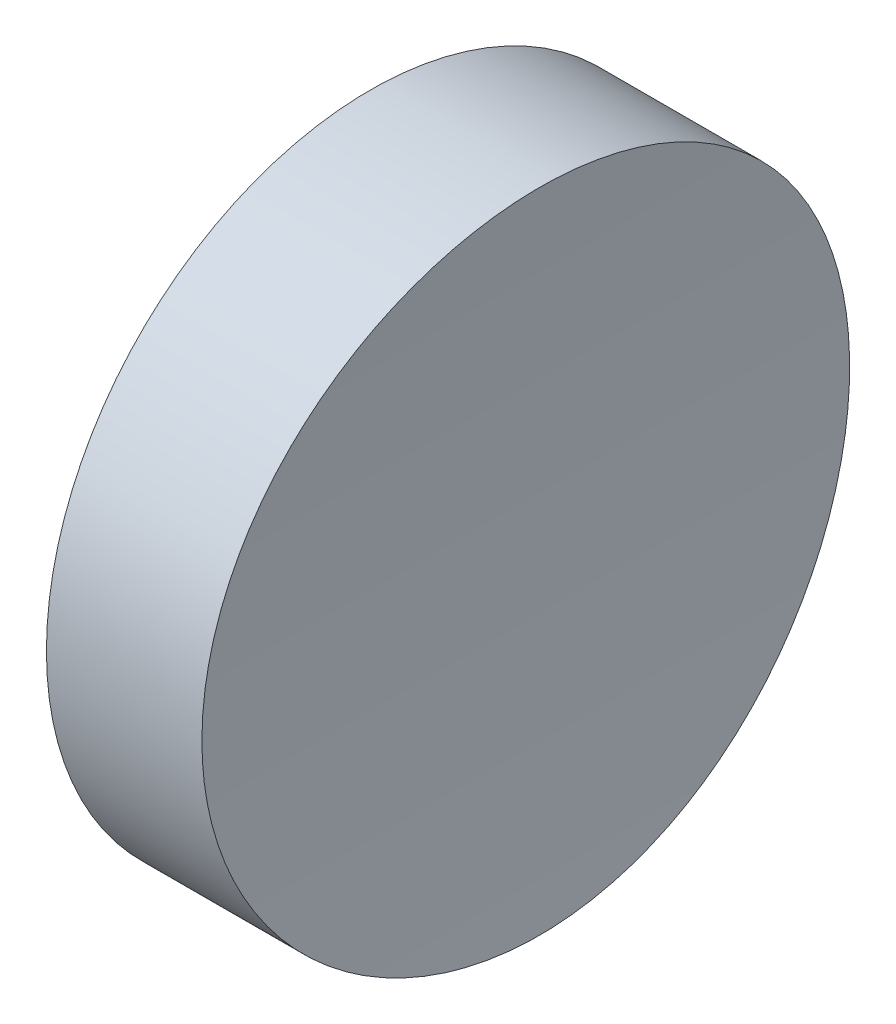
ISO-10303-21;
HEADER;
FILE_DESCRIPTION(('STEP AP214'),'2;1');
FILE_NAME('part.step','',(''),(''),'','','');
FILE_SCHEMA(('AUTOMOTIVE_DESIGN { 1 0 10303 214 1 1 1 1 }'));
ENDSEC;
DATA;
#1=APPLICATION_CONTEXT('core data for automotive mechanical design processes');
#2=APPLICATION_PROTOCOL_DEFINITION('international standard','automotive_design',2000,#1);
#3=PRODUCT_CONTEXT('',#1,'mechanical');
#4=PRODUCT('Part','Part','',(#3));
#5=PRODUCT_RELATED_PRODUCT_CATEGORY('part','',(#4));
#6=PRODUCT_DEFINITION_FORMATION('','',#4);
#7=PRODUCT_DEFINITION_CONTEXT('part definition',#1,'design');
#8=PRODUCT_DEFINITION('design','',#6,#7);
#9=PRODUCT_DEFINITION_SHAPE('','',#8);
#10=(LENGTH_UNIT() NAMED_UNIT(*) SI_UNIT(.MILLI.,.METRE.));
#11=(NAMED_UNIT(*) PLANE_ANGLE_UNIT() SI_UNIT($,.RADIAN.));
#12=(NAMED_UNIT(*) SI_UNIT($,.STERADIAN.) SOLID_ANGLE_UNIT());
#13=UNCERTAINTY_MEASURE_WITH_UNIT(LENGTH_MEASURE(1.E-05),#10,'distance_accuracy_value','');
#14=(GEOMETRIC_REPRESENTATION_CONTEXT(3) GLOBAL_UNCERTAINTY_ASSIGNED_CONTEXT((#13)) GLOBAL_UNIT_ASSIGNED_CONTEXT((#10,
#11,#12)) REPRESENTATION_CONTEXT('',''));
#15=CARTESIAN_POINT('',(0.,0.,0.));
#16=DIRECTION('',(0.,0.,1.));
#17=DIRECTION('',(1.,0.,0.));
#18=AXIS2_PLACEMENT_3D('',#15,#16,#17);
#19=CARTESIAN_POINT('',(10.,0.,0.));
#20=DIRECTION('',(-1.,0.,0.));
#21=DIRECTION('',(0.,0.,1.));
#22=AXIS2_PLACEMENT_3D('',#19,#20,#21);
#23=CYLINDRICAL_SURFACE('',#22,12.5);
#24=CARTESIAN_POINT('',(5.99999999999998,0.,12.5));
#25=CARTESIAN_POINT('',(5.99999928146033,0.350537754396186,12.5000031495883));
#26=CARTESIAN_POINT('',(6.0012312827096,0.701026373216591,12.4852490726767));
#27=CARTESIAN_POINT('',(6.00612333447652,1.39962024008817,12.4263402743586));
#28=CARTESIAN_POINT('',(6.00978398461746,1.7477248780951,12.3821782922528));
#29=CARTESIAN_POINT('',(6.01943610217294,2.43930253725407,12.26470389551));
#30=CARTESIAN_POINT('',(6.02542992274448,2.78277051902057,12.1913620493917));
#31=CARTESIAN_POINT('',(6.03957819863503,3.46227926252326,12.0160614654325));
#32=CARTESIAN_POINT('',(6.04773264928052,3.79832004032309,11.914102789491));
#33=CARTESIAN_POINT('',(6.06596626541404,4.46039786220219,11.6823710709163));
#34=CARTESIAN_POINT('',(6.07604432051498,4.78644055219778,11.5526140694069));
#35=CARTESIAN_POINT('',(6.0978438268502,5.42642639750804,11.2661796907292));
#36=CARTESIAN_POINT('',(6.10956530212955,5.74036937570474,11.1095019196725));
#37=CARTESIAN_POINT('',(6.13431824496103,6.35387095131918,10.7703826988102));
#38=CARTESIAN_POINT('',(6.14734941937173,6.65343274550162,10.5879470105476));
#39=CARTESIAN_POINT('',(6.17435691761398,7.23614274206486,10.1985797020899));
#40=CARTESIAN_POINT('',(6.18833323979202,7.51929097315935,9.99164812474965));
#41=CARTESIAN_POINT('',(6.21686991078753,8.06780950182983,9.55425424401204));
#42=CARTESIAN_POINT('',(6.23143150925087,8.33313813367743,9.32373976902612));
#43=CARTESIAN_POINT('',(6.2606971957962,8.84344570500622,8.8411980957912));
#44=CARTESIAN_POINT('',(6.27540128420837,9.08842459732109,8.58917084768296));
#45=CARTESIAN_POINT('',(6.30453645727553,9.55631508060749,8.06536854380081));
#46=CARTESIAN_POINT('',(6.3189675300547,9.779225713416,7.79359263146396));
#47=CARTESIAN_POINT('',(6.3471470781203,10.2013912999658,7.23221662343334));
#48=CARTESIAN_POINT('',(6.36089555325487,10.4006462484445,6.9426165237743));
#49=CARTESIAN_POINT('',(6.38733895253603,10.7743590342736,6.34719730255701));
#50=CARTESIAN_POINT('',(6.40003230707307,10.9487801939426,6.04135508875667));
#51=CARTESIAN_POINT('',(6.42398082168204,11.2712305985622,5.41600588054904));
#52=CARTESIAN_POINT('',(6.43523597987367,11.4192598090079,5.09649886827695));
#53=CARTESIAN_POINT('',(6.4559860375815,11.6878588861224,4.4460933167239));
#54=CARTESIAN_POINT('',(6.46548096178339,11.8084291378836,4.11519493727364));
#55=CARTESIAN_POINT('',(6.48243851380208,12.021240058768,3.44435967779192));
#56=CARTESIAN_POINT('',(6.48990114666187,12.113480798189,3.10442282019107));
#57=CARTESIAN_POINT('',(6.50256490465505,12.2687800060287,2.41874282570008));
#58=CARTESIAN_POINT('',(6.50777128099369,12.3319062576904,2.07301513732543));
#59=CARTESIAN_POINT('',(6.51579874392335,12.428835236807,1.37744579459053));
#60=CARTESIAN_POINT('',(6.5186198338476,12.462638005239,1.02760414597988));
#61=CARTESIAN_POINT('',(6.52179579190806,12.5006733071993,0.326311773981347));
#62=CARTESIAN_POINT('',(6.52215070140543,12.5049063366519,-0.0251389223217206));
#63=CARTESIAN_POINT('',(6.52038421766945,12.4837725478088,-0.727142680080485));
#64=CARTESIAN_POINT('',(6.51826282774346,12.4584057690467,-1.07769574273444));
#65=CARTESIAN_POINT('',(6.51161300085618,12.3783583715258,-1.77452230633597));
#66=CARTESIAN_POINT('',(6.50709062363346,12.3237515473762,-2.12080434534615));
#67=CARTESIAN_POINT('',(6.49577155498858,12.1856665327574,-2.8075245167755));
#68=CARTESIAN_POINT('',(6.48897486797711,12.1021883982798,-3.1479626605267));
#69=CARTESIAN_POINT('',(6.47330061137972,11.906962237216,-3.82058709979784));
#70=CARTESIAN_POINT('',(6.46442302710651,11.7952140110946,-4.15277333705625));
#71=CARTESIAN_POINT('',(6.44483920460298,11.5442500192157,-4.80654688145646));
#72=CARTESIAN_POINT('',(6.43413296294578,11.4050342019842,-5.1281341687346));
#73=CARTESIAN_POINT('',(6.4111809805038,11.0999388130492,-5.75883922992113));
#74=CARTESIAN_POINT('',(6.39893333828257,10.9340262371883,-6.06794096893111));
#75=CARTESIAN_POINT('',(6.37325621908973,10.5768421254075,-6.67107556638572));
#76=CARTESIAN_POINT('',(6.35982674148264,10.3855705758516,-6.96510841672741));
#77=CARTESIAN_POINT('',(6.33216553062023,9.97901904443404,-7.53604635099387));
#78=CARTESIAN_POINT('',(6.31793378366521,9.76373865253137,-7.8129511422672));
#79=CARTESIAN_POINT('',(6.28906997516907,9.31068930058814,-8.34768616760569));
#80=CARTESIAN_POINT('',(6.27443791277051,9.07292029237624,-8.60551636081034));
#81=CARTESIAN_POINT('',(6.24514117853455,8.57580467050511,-9.1010504528943));
#82=CARTESIAN_POINT('',(6.23047654381058,8.31639429480903,-9.33869039322468));
#83=CARTESIAN_POINT('',(6.20157503676616,7.77845829161841,-9.79127877092119));
#84=CARTESIAN_POINT('',(6.18733816537446,7.49993262262623,-10.0062271590234));
#85=CARTESIAN_POINT('',(6.15969549519396,6.92573076623681,-10.4119078143583));
#86=CARTESIAN_POINT('',(6.14628969804599,6.63005454498069,-10.6026400337808));
#87=CARTESIAN_POINT('',(6.1206891095364,6.02364083883929,-10.9585286064737));
#88=CARTESIAN_POINT('',(6.10849431705849,5.71290336783776,-11.1236849833197));
#89=CARTESIAN_POINT('',(6.08566030169242,5.07853190429446,-11.4272556792948));
#90=CARTESIAN_POINT('',(6.07502124876219,4.75489650761649,-11.5656670771788));
#91=CARTESIAN_POINT('',(6.05560238636079,4.0970591260334,-11.8147281602823));
#92=CARTESIAN_POINT('',(6.04682257767529,3.76285713666319,-11.9253778337704));
#93=CARTESIAN_POINT('',(6.03137192915,3.08627344867466,-12.1181121422099));
#94=CARTESIAN_POINT('',(6.02470105351482,2.74389188899613,-12.2001972619962));
#95=CARTESIAN_POINT('',(6.01365793067234,2.05339058140679,-12.3352073790356));
#96=CARTESIAN_POINT('',(6.00928567753806,1.70527084829418,-12.3881324514775));
#97=CARTESIAN_POINT('',(6.00297375724905,1.00683381188401,-12.4643219427479));
#98=CARTESIAN_POINT('',(6.00102684947684,0.656526202705502,-12.487674650278));
#99=CARTESIAN_POINT('',(5.99959679867223,-0.0448167124021891,-12.5048404592398));
#100=CARTESIAN_POINT('',(6.00011365075054,-0.395852016885884,-12.4986536192926));
#101=CARTESIAN_POINT('',(6.00359645727859,-1.09614364513738,-12.4567856464168));
#102=CARTESIAN_POINT('',(6.00656238976312,-1.44539998483202,-12.421104778013));
#103=CARTESIAN_POINT('',(6.01485932370455,-2.13964801915374,-12.3205085648779));
#104=CARTESIAN_POINT('',(6.02019032468183,-2.48463971464565,-12.2555932260751));
#105=CARTESIAN_POINT('',(6.03305729640805,-3.16741633217468,-12.097112223057));
#106=CARTESIAN_POINT('',(6.04059010950767,-3.50521083660663,-12.0035875789644));
#107=CARTESIAN_POINT('',(6.05765117775656,-4.17171048696242,-11.7885304224186));
#108=CARTESIAN_POINT('',(6.06717943032533,-4.50041564463991,-11.666997946185));
#109=CARTESIAN_POINT('',(6.08796317719186,-5.14642297681508,-11.3967941230233));
#110=CARTESIAN_POINT('',(6.0992186926505,-5.46372501155306,-11.2481224436056));
#111=CARTESIAN_POINT('',(6.12314026812197,-6.08469189106629,-10.9247002689698));
#112=CARTESIAN_POINT('',(6.13580633156477,-6.388356702678,-10.7499497103364));
#113=CARTESIAN_POINT('',(6.16222406542286,-6.98061545800222,-10.3751676631252));
#114=CARTESIAN_POINT('',(6.17597821761808,-7.26917229931269,-10.1750777162666));
#115=CARTESIAN_POINT('',(6.20415792203051,-7.82841625997504,-9.75135748159222));
#116=CARTESIAN_POINT('',(6.21858347518462,-8.09910335438983,-9.52772716092724));
#117=CARTESIAN_POINT('',(6.24769913592004,-8.62070966740436,-9.05850033462086));
#118=CARTESIAN_POINT('',(6.2623892475736,-8.87162858139986,-8.81290349062584));
#119=CARTESIAN_POINT('',(6.29161906646477,-9.35192933719651,-8.30147458126343));
#120=CARTESIAN_POINT('',(6.30615877350483,-9.58131115071401,-8.03564248932291));
#121=CARTESIAN_POINT('',(6.33471233184105,-10.0174629899683,-7.48492621612523));
#122=CARTESIAN_POINT('',(6.34872478465277,-10.2241753316163,-7.19999627428991));
#123=CARTESIAN_POINT('',(6.37578685902222,-10.6128606640624,-6.61369008796645));
#124=CARTESIAN_POINT('',(6.388836478729,-10.7948336073015,-6.31231381186345));
#125=CARTESIAN_POINT('',(6.41360072671689,-11.1327384965014,-5.69524970587708));
#126=CARTESIAN_POINT('',(6.42531536464488,-11.2886706306427,-5.37956197943448));
#127=CARTESIAN_POINT('',(6.44707495895922,-11.5733749752995,-4.73611252658949));
#128=CARTESIAN_POINT('',(6.45711991851666,-11.7021472373976,-4.40835082311971));
#129=CARTESIAN_POINT('',(6.47524105989593,-11.9314578630839,-3.7435023495797));
#130=CARTESIAN_POINT('',(6.4833196941744,-12.0320314209429,-3.40642778544829));
#131=CARTESIAN_POINT('',(6.49729310428606,-12.2044303179048,-2.7249605060704));
#132=CARTESIAN_POINT('',(6.50318788132406,-12.2762556728677,-2.38056779486136));
#133=CARTESIAN_POINT('',(6.51262435945935,-12.3906345006923,-1.68692887576776));
#134=CARTESIAN_POINT('',(6.5161660982026,-12.4331884418642,-1.3376827456237));
#135=CARTESIAN_POINT('',(6.52079487519413,-12.4887154978616,-0.636830870202419));
#136=CARTESIAN_POINT('',(6.52188191876449,-12.5016886768221,-0.285225130042782));
#137=CARTESIAN_POINT('',(6.52157057268264,-12.497965356281,0.416752217799929));
#138=CARTESIAN_POINT('',(6.52017977002853,-12.4813594260491,0.767124312682886));
#139=CARTESIAN_POINT('',(6.51496720479426,-12.4187742209256,1.46521624440075));
#140=CARTESIAN_POINT('',(6.51114544751155,-12.3727950100434,1.81293608701368));
#141=CARTESIAN_POINT('',(6.50118009481151,-12.2517968263356,2.50325168598202));
#142=CARTESIAN_POINT('',(6.49503649895016,-12.1767778479563,2.84584744135748));
#143=CARTESIAN_POINT('',(6.48060263209619,-11.9982424605483,3.52348479078322));
#144=CARTESIAN_POINT('',(6.47231235909712,-11.8947260248835,3.85852637777244));
#145=CARTESIAN_POINT('',(6.45382163339658,-11.659948061712,4.51866459979813));
#146=CARTESIAN_POINT('',(6.44362129942763,-11.5286882587132,4.8437618515302));
#147=CARTESIAN_POINT('',(6.42159969040552,-11.2393592320345,5.48174120929249));
#148=CARTESIAN_POINT('',(6.40977841570631,-11.0812900142089,5.79462331799004));
#149=CARTESIAN_POINT('',(6.38484994113602,-10.7394702994248,6.40596762405079));
#150=CARTESIAN_POINT('',(6.37174276584707,-10.5557202933691,6.70443009690677));
#151=CARTESIAN_POINT('',(6.34461261678337,-10.1638372440364,7.28484920740848));
#152=CARTESIAN_POINT('',(6.33058964155154,-9.95570416196478,7.56680581879155));
#153=CARTESIAN_POINT('',(6.30198155676177,-9.51587956857796,8.11303563657764));
#154=CARTESIAN_POINT('',(6.28739492585279,-9.28412106526727,8.37725482411943));
#155=CARTESIAN_POINT('',(6.25811117322026,-8.79918843661238,8.88524550055078));
#156=CARTESIAN_POINT('',(6.24341405087085,-8.54601418987609,9.12901687351922));
#157=CARTESIAN_POINT('',(6.21432150833528,-8.01996944256351,9.59444931992474));
#158=CARTESIAN_POINT('',(6.19992616376838,-7.74709407965361,9.8161049027005));
#159=CARTESIAN_POINT('',(6.17184836662671,-7.18362934345751,10.235665544384));
#160=CARTESIAN_POINT('',(6.15816590358759,-6.89304023032665,10.4335709519751));
#161=CARTESIAN_POINT('',(6.13187611054748,-6.29563234698706,10.8045767090777));
#162=CARTESIAN_POINT('',(6.11927084264579,-5.98878419301035,10.9776298959265));
#163=CARTESIAN_POINT('',(6.09552233611512,-5.36153611761585,11.2972489779576));
#164=CARTESIAN_POINT('',(6.08437910088157,-5.04113616472762,11.4438148116258));
#165=CARTESIAN_POINT('',(6.06388222328109,-4.38938948003519,11.7092667591708));
#166=CARTESIAN_POINT('',(6.05452675287682,-4.05805434084804,11.8281811746445));
#167=CARTESIAN_POINT('',(6.03785895292901,-3.38660067761245,12.0376335327089));
#168=CARTESIAN_POINT('',(6.03054611085396,-3.04648438035253,12.1281785943665));
#169=CARTESIAN_POINT('',(6.01636937825594,-2.25982768639742,12.302406111513));
#170=CARTESIAN_POINT('',(6.01025451321463,-1.81110218882432,12.3764352192388));
#171=CARTESIAN_POINT('',(6.00207029483881,-0.908223635663069,12.4752300581684));
#172=CARTESIAN_POINT('',(6.00000093076341,-0.454070594488379,12.4999959201672));
#173=CARTESIAN_POINT('',(5.99999999999998,0.,12.5));
#174=B_SPLINE_CURVE_WITH_KNOTS('',3,(#24,#25,#26,#27,#28,#29,#30,#31,#32,#33,#34,#35,#36,#37,
#38,#39,#40,#41,#42,#43,#44,#45,#46,#47,#48,#49,#50,#51,#52,#53,#54,#55,#56,#57,#58,#59,#60,#61,
#62,#63,#64,#65,#66,#67,#68,#69,#70,#71,#72,#73,#74,#75,#76,#77,#78,#79,#80,#81,#82,#83,#84,#85,
#86,#87,#88,#89,#90,#91,#92,#93,#94,#95,#96,#97,#98,#99,#100,#101,#102,#103,#104,#105,#106,#107,
#108,#109,#110,#111,#112,#113,#114,#115,#116,#117,#118,#119,#120,#121,#122,#123,#124,#125,#126,
#127,#128,#129,#130,#131,#132,#133,#134,#135,#136,#137,#138,#139,#140,#141,#142,#143,#144,#145,
#146,#147,#148,#149,#150,#151,#152,#153,#154,#155,#156,#157,#158,#159,#160,#161,#162,#163,#164,
#165,#166,#167,#168,#169,#170,#171,#172,#173),.UNSPECIFIED.,.T.,.F.,(4,2,2,2,2,2,2,2,2,2,2,2,2,
2,2,2,2,2,2,2,2,2,2,2,2,2,2,2,2,2,2,2,2,2,2,2,2,2,2,2,2,2,2,2,2,2,2,2,2,2,2,2,2,2,2,2,2,2,2,2,2,
2,2,2,2,2,2,2,2,2,2,2,2,2,4),(0.,1.05121632298732,2.1026922835389,3.1552314864778,
4.20776841274987,5.25969959697665,6.31164617373491,7.3633578222745,8.41506763090776,
9.46915658779819,10.5232479877717,11.5773851343913,12.6315225155202,13.6872009793984,
14.7428808234693,15.7985458614751,16.8542082799024,17.9074003820974,18.9605910125463,
20.0137639795315,21.0669355398966,22.1174615985824,23.1679856199371,24.218517056273,
25.2690504613134,26.3208927213669,27.3727355470182,28.4245963395825,29.4764593853177,
30.5315390901326,31.5866210855064,32.6417051639097,33.6967882697343,34.7519865529233,
35.8071852820107,36.8623661000113,37.9175441972294,38.9695645609881,40.0215828370235,
41.073591677863,42.1256003053619,43.1761075735598,44.2266134832576,45.2771322638458,
46.3276535989885,47.3806442242893,48.4336363189992,49.4866446358969,50.5396543356407,
51.5952841919123,52.6509160774975,53.7065403343677,54.7621625863508,55.8164614110759,
56.870759654157,57.9250410292484,58.9793201185211,60.0303766222171,61.0814308354967,
62.1324852497825,63.1835406464727,64.2345307295175,65.2855205830637,66.3364903490909,
67.3874617872821,68.4415009335447,69.4955460548786,70.5498522149917,71.6041428946265,
72.6604086119521,73.716676782309,74.7718590421101,75.8267762997221,77.1884775203318,
78.5501751255925),.UNSPECIFIED.);
#175=CARTESIAN_POINT('',(5.99999999999998,0.,12.5));
#176=VERTEX_POINT('',#175);
#177=EDGE_CURVE('E10',#176,#176,#174,.T.);
#178=ORIENTED_EDGE('',*,*,#177,.T.);
#179=EDGE_LOOP('',(#178));
#180=FACE_BOUND('',#179,.T.);
#181=CARTESIAN_POINT('',(0.,0.,0.));
#182=DIRECTION('',(1.,0.,0.));
#183=DIRECTION('',(0.,0.,-1.));
#184=AXIS2_PLACEMENT_3D('',#181,#182,#183);
#185=CIRCLE('',#184,12.5);
#186=CARTESIAN_POINT('',(0.,0.,-12.5));
#187=VERTEX_POINT('',#186);
#188=EDGE_CURVE('E46',#187,#187,#185,.T.);
#189=ORIENTED_EDGE('',*,*,#188,.T.);
#190=EDGE_LOOP('',(#189));
#191=FACE_BOUND('',#190,.T.);
#192=ADVANCED_FACE('F35',(#180,#191),#23,.T.);
#193=CARTESIAN_POINT('',(0.,0.,0.));
#194=DIRECTION('',(1.,0.,0.));
#195=DIRECTION('',(0.,0.,-1.));
#196=AXIS2_PLACEMENT_3D('',#193,#194,#195);
#197=PLANE('',#196);
#198=ORIENTED_EDGE('',*,*,#188,.F.);
#199=EDGE_LOOP('',(#198));
#200=FACE_BOUND('',#199,.T.);
#201=ADVANCED_FACE('F53',(#200),#197,.F.);
#202=CARTESIAN_POINT('',(156.,0.,-12.5));
#203=DIRECTION('',(0.,0.,1.));
#204=DIRECTION('',(1.,0.,0.));
#205=AXIS2_PLACEMENT_3D('',#202,#203,#204);
#206=CYLINDRICAL_SURFACE('',#205,150.);
#207=ORIENTED_EDGE('',*,*,#177,.F.);
#208=EDGE_LOOP('',(#207));
#209=FACE_BOUND('',#208,.T.);
#210=ADVANCED_FACE('F55',(#209),#206,.F.);
#211=CLOSED_SHELL('',(#192,#201,#210));
#212=MANIFOLD_SOLID_BREP('B2',#211);
#213=ADVANCED_BREP_SHAPE_REPRESENTATION('',(#18,#212),#14);
#214=SHAPE_DEFINITION_REPRESENTATION(#9,#213);
ENDSEC;
END-ISO-10303-21;
